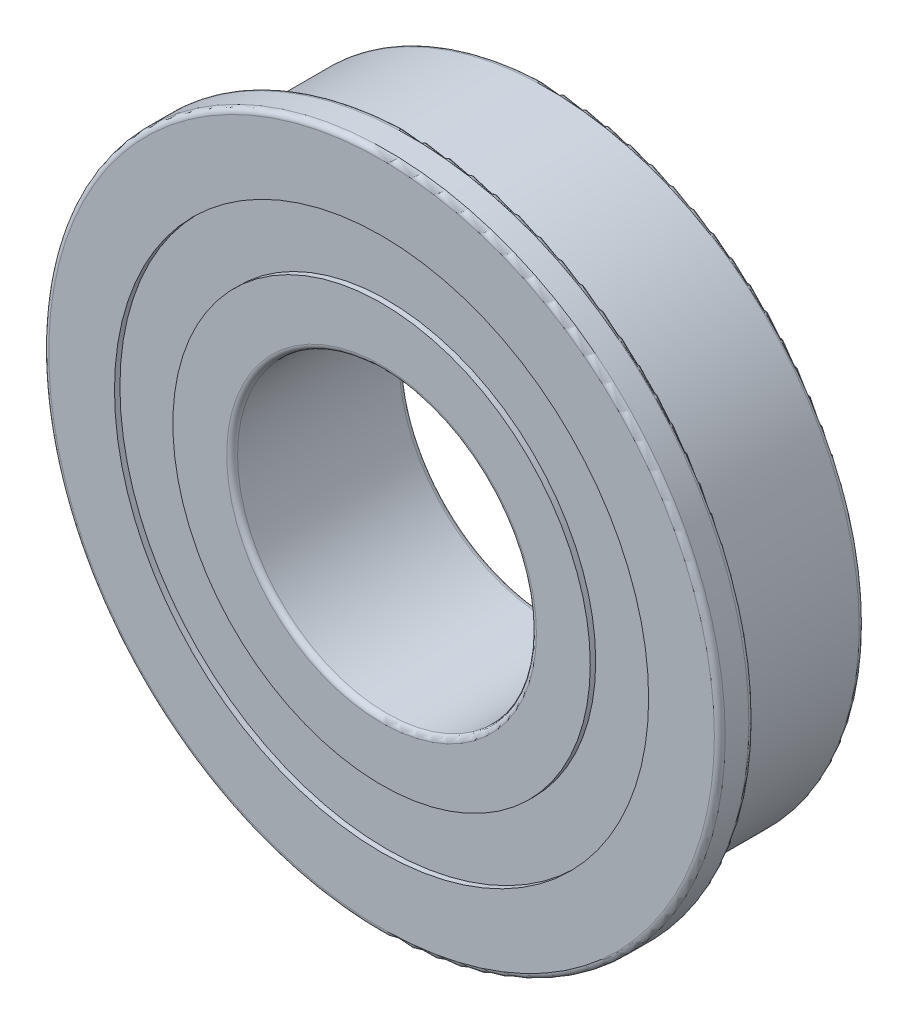
ISO-10303-21;
HEADER;
FILE_DESCRIPTION(('STEP AP214'),'2;1');
FILE_NAME('part.step','',(''),(''),'','','');
FILE_SCHEMA(('AUTOMOTIVE_DESIGN { 1 0 10303 214 1 1 1 1 }'));
ENDSEC;
DATA;
#1=APPLICATION_CONTEXT('core data for automotive mechanical design processes');
#2=APPLICATION_PROTOCOL_DEFINITION('international standard','automotive_design',2000,#1);
#3=PRODUCT_CONTEXT('',#1,'mechanical');
#4=PRODUCT('Part','Part','',(#3));
#5=PRODUCT_RELATED_PRODUCT_CATEGORY('part','',(#4));
#6=PRODUCT_DEFINITION_FORMATION('','',#4);
#7=PRODUCT_DEFINITION_CONTEXT('part definition',#1,'design');
#8=PRODUCT_DEFINITION('design','',#6,#7);
#9=PRODUCT_DEFINITION_SHAPE('','',#8);
#10=(LENGTH_UNIT() NAMED_UNIT(*) SI_UNIT(.MILLI.,.METRE.));
#11=(NAMED_UNIT(*) PLANE_ANGLE_UNIT() SI_UNIT($,.RADIAN.));
#12=(NAMED_UNIT(*) SI_UNIT($,.STERADIAN.) SOLID_ANGLE_UNIT());
#13=UNCERTAINTY_MEASURE_WITH_UNIT(LENGTH_MEASURE(1.E-05),#10,'distance_accuracy_value','');
#14=(GEOMETRIC_REPRESENTATION_CONTEXT(3) GLOBAL_UNCERTAINTY_ASSIGNED_CONTEXT((#13)) GLOBAL_UNIT_ASSIGNED_CONTEXT((#10,
#11,#12)) REPRESENTATION_CONTEXT('',''));
#15=CARTESIAN_POINT('',(0.,0.,0.));
#16=DIRECTION('',(0.,0.,1.));
#17=DIRECTION('',(1.,0.,0.));
#18=AXIS2_PLACEMENT_3D('',#15,#16,#17);
#19=CARTESIAN_POINT('',(0.,0.,-3.71875));
#20=DIRECTION('',(0.,0.,1.));
#21=DIRECTION('',(1.,0.,0.));
#22=AXIS2_PLACEMENT_3D('',#19,#20,#21);
#23=TOROIDAL_SURFACE('',#22,14.0375,0.25);
#24=CARTESIAN_POINT('',(0.,0.,-3.96875));
#25=DIRECTION('',(0.,0.,1.));
#26=DIRECTION('',(1.,0.,0.));
#27=AXIS2_PLACEMENT_3D('',#24,#25,#26);
#28=CIRCLE('',#27,14.0375);
#29=CARTESIAN_POINT('',(14.0375,0.,-3.96875));
#30=VERTEX_POINT('',#29);
#31=EDGE_CURVE('E10',#30,#30,#28,.T.);
#32=ORIENTED_EDGE('',*,*,#31,.T.);
#33=EDGE_LOOP('',(#32));
#34=FACE_BOUND('',#33,.T.);
#35=CARTESIAN_POINT('',(0.,0.,-3.71875));
#36=DIRECTION('',(0.,0.,1.));
#37=DIRECTION('',(1.,0.,0.));
#38=AXIS2_PLACEMENT_3D('',#35,#36,#37);
#39=CIRCLE('',#38,14.2875);
#40=CARTESIAN_POINT('',(14.2875,0.,-3.71875));
#41=VERTEX_POINT('',#40);
#42=EDGE_CURVE('E99',#41,#41,#39,.T.);
#43=ORIENTED_EDGE('',*,*,#42,.F.);
#44=EDGE_LOOP('',(#43));
#45=FACE_BOUND('',#44,.T.);
#46=ADVANCED_FACE('F32',(#34,#45),#23,.T.);
#47=CARTESIAN_POINT('',(14.0375,0.,-3.96875));
#48=DIRECTION('',(0.,0.,-1.));
#49=DIRECTION('',(-1.,0.,0.));
#50=AXIS2_PLACEMENT_3D('',#47,#48,#49);
#51=PLANE('',#50);
#52=CARTESIAN_POINT('',(0.,0.,-3.96875));
#53=DIRECTION('',(0.,0.,1.));
#54=DIRECTION('',(1.,0.,0.));
#55=AXIS2_PLACEMENT_3D('',#52,#53,#54);
#56=CIRCLE('',#55,12.2875);
#57=CARTESIAN_POINT('',(12.2875,0.,-3.96875));
#58=VERTEX_POINT('',#57);
#59=EDGE_CURVE('E38',#58,#58,#56,.T.);
#60=ORIENTED_EDGE('',*,*,#59,.T.);
#61=EDGE_LOOP('',(#60));
#62=FACE_BOUND('',#61,.T.);
#63=ORIENTED_EDGE('',*,*,#31,.F.);
#64=EDGE_LOOP('',(#63));
#65=FACE_BOUND('',#64,.T.);
#66=ADVANCED_FACE('F107',(#62,#65),#51,.T.);
#67=CARTESIAN_POINT('',(0.,0.,-3.9700039936204));
#68=DIRECTION('',(0.,0.,1.));
#69=DIRECTION('',(1.,0.,0.));
#70=AXIS2_PLACEMENT_3D('',#67,#68,#69);
#71=CYLINDRICAL_SURFACE('',#70,12.2875);
#72=CARTESIAN_POINT('',(0.,0.,-3.71875));
#73=DIRECTION('',(0.,0.,1.));
#74=DIRECTION('',(1.,0.,0.));
#75=AXIS2_PLACEMENT_3D('',#72,#73,#74);
#76=CIRCLE('',#75,12.2875);
#77=CARTESIAN_POINT('',(12.2875,0.,-3.71875));
#78=VERTEX_POINT('',#77);
#79=EDGE_CURVE('E42',#78,#78,#76,.T.);
#80=ORIENTED_EDGE('',*,*,#79,.T.);
#81=EDGE_LOOP('',(#80));
#82=FACE_BOUND('',#81,.T.);
#83=ORIENTED_EDGE('',*,*,#59,.F.);
#84=EDGE_LOOP('',(#83));
#85=FACE_BOUND('',#84,.T.);
#86=ADVANCED_FACE('F111',(#82,#85),#71,.F.);
#87=CARTESIAN_POINT('',(12.2875,0.,-3.71875));
#88=DIRECTION('',(0.,0.,-1.));
#89=DIRECTION('',(-1.,0.,0.));
#90=AXIS2_PLACEMENT_3D('',#87,#88,#89);
#91=PLANE('',#90);
#92=CARTESIAN_POINT('',(0.,0.,-3.71875));
#93=DIRECTION('',(0.,0.,1.));
#94=DIRECTION('',(1.,0.,0.));
#95=AXIS2_PLACEMENT_3D('',#92,#93,#94);
#96=CIRCLE('',#95,9.602);
#97=CARTESIAN_POINT('',(9.602,0.,-3.71875));
#98=VERTEX_POINT('',#97);
#99=EDGE_CURVE('E46',#98,#98,#96,.T.);
#100=ORIENTED_EDGE('',*,*,#99,.T.);
#101=EDGE_LOOP('',(#100));
#102=FACE_BOUND('',#101,.T.);
#103=ORIENTED_EDGE('',*,*,#79,.F.);
#104=EDGE_LOOP('',(#103));
#105=FACE_BOUND('',#104,.T.);
#106=ADVANCED_FACE('F115',(#102,#105),#91,.T.);
#107=CARTESIAN_POINT('',(0.,0.,-3.9700039936204));
#108=DIRECTION('',(0.,0.,1.));
#109=DIRECTION('',(1.,0.,0.));
#110=AXIS2_PLACEMENT_3D('',#107,#108,#109);
#111=CYLINDRICAL_SURFACE('',#110,9.602);
#112=CARTESIAN_POINT('',(0.,0.,-3.96875));
#113=DIRECTION('',(0.,0.,1.));
#114=DIRECTION('',(1.,0.,0.));
#115=AXIS2_PLACEMENT_3D('',#112,#113,#114);
#116=CIRCLE('',#115,9.602);
#117=CARTESIAN_POINT('',(9.602,0.,-3.96875));
#118=VERTEX_POINT('',#117);
#119=EDGE_CURVE('E51',#118,#118,#116,.T.);
#120=ORIENTED_EDGE('',*,*,#119,.T.);
#121=EDGE_LOOP('',(#120));
#122=FACE_BOUND('',#121,.T.);
#123=ORIENTED_EDGE('',*,*,#99,.F.);
#124=EDGE_LOOP('',(#123));
#125=FACE_BOUND('',#124,.T.);
#126=ADVANCED_FACE('F122',(#122,#125),#111,.T.);
#127=CARTESIAN_POINT('',(9.602,0.,-3.96875));
#128=DIRECTION('',(0.,0.,-1.));
#129=DIRECTION('',(-1.,0.,0.));
#130=AXIS2_PLACEMENT_3D('',#127,#128,#129);
#131=PLANE('',#130);
#132=CARTESIAN_POINT('',(0.,0.,-3.96875));
#133=DIRECTION('',(0.,0.,1.));
#134=DIRECTION('',(1.,0.,0.));
#135=AXIS2_PLACEMENT_3D('',#132,#133,#134);
#136=CIRCLE('',#135,7.125);
#137=CARTESIAN_POINT('',(7.125,0.,-3.96875));
#138=VERTEX_POINT('',#137);
#139=EDGE_CURVE('E54',#138,#138,#136,.T.);
#140=ORIENTED_EDGE('',*,*,#139,.T.);
#141=EDGE_LOOP('',(#140));
#142=FACE_BOUND('',#141,.T.);
#143=ORIENTED_EDGE('',*,*,#119,.F.);
#144=EDGE_LOOP('',(#143));
#145=FACE_BOUND('',#144,.T.);
#146=ADVANCED_FACE('F126',(#142,#145),#131,.T.);
#147=CARTESIAN_POINT('',(0.,0.,-3.71875));
#148=DIRECTION('',(0.,0.,1.));
#149=DIRECTION('',(1.,0.,0.));
#150=AXIS2_PLACEMENT_3D('',#147,#148,#149);
#151=TOROIDAL_SURFACE('',#150,7.125,0.25);
#152=CARTESIAN_POINT('',(0.,0.,-3.71875));
#153=DIRECTION('',(0.,0.,1.));
#154=DIRECTION('',(1.,0.,0.));
#155=AXIS2_PLACEMENT_3D('',#152,#153,#154);
#156=CIRCLE('',#155,6.875);
#157=CARTESIAN_POINT('',(6.875,0.,-3.71875));
#158=VERTEX_POINT('',#157);
#159=EDGE_CURVE('E57',#158,#158,#156,.T.);
#160=ORIENTED_EDGE('',*,*,#159,.T.);
#161=EDGE_LOOP('',(#160));
#162=FACE_BOUND('',#161,.T.);
#163=ORIENTED_EDGE('',*,*,#139,.F.);
#164=EDGE_LOOP('',(#163));
#165=FACE_BOUND('',#164,.T.);
#166=ADVANCED_FACE('F130',(#162,#165),#151,.T.);
#167=CARTESIAN_POINT('',(0.,0.,-3.9700039936204));
#168=DIRECTION('',(0.,0.,1.));
#169=DIRECTION('',(1.,0.,0.));
#170=AXIS2_PLACEMENT_3D('',#167,#168,#169);
#171=CYLINDRICAL_SURFACE('',#170,6.875);
#172=CARTESIAN_POINT('',(0.,0.,3.71875));
#173=DIRECTION('',(0.,0.,1.));
#174=DIRECTION('',(1.,0.,0.));
#175=AXIS2_PLACEMENT_3D('',#172,#173,#174);
#176=CIRCLE('',#175,6.875);
#177=CARTESIAN_POINT('',(6.875,0.,3.71875));
#178=VERTEX_POINT('',#177);
#179=EDGE_CURVE('E60',#178,#178,#176,.T.);
#180=ORIENTED_EDGE('',*,*,#179,.T.);
#181=EDGE_LOOP('',(#180));
#182=FACE_BOUND('',#181,.T.);
#183=ORIENTED_EDGE('',*,*,#159,.F.);
#184=EDGE_LOOP('',(#183));
#185=FACE_BOUND('',#184,.T.);
#186=ADVANCED_FACE('F134',(#182,#185),#171,.F.);
#187=CARTESIAN_POINT('',(0.,0.,3.71875));
#188=DIRECTION('',(0.,0.,1.));
#189=DIRECTION('',(1.,0.,0.));
#190=AXIS2_PLACEMENT_3D('',#187,#188,#189);
#191=TOROIDAL_SURFACE('',#190,7.125,0.25);
#192=CARTESIAN_POINT('',(0.,0.,3.96875));
#193=DIRECTION('',(0.,0.,1.));
#194=DIRECTION('',(1.,0.,0.));
#195=AXIS2_PLACEMENT_3D('',#192,#193,#194);
#196=CIRCLE('',#195,7.125);
#197=CARTESIAN_POINT('',(7.125,0.,3.96875));
#198=VERTEX_POINT('',#197);
#199=EDGE_CURVE('E63',#198,#198,#196,.T.);
#200=ORIENTED_EDGE('',*,*,#199,.T.);
#201=EDGE_LOOP('',(#200));
#202=FACE_BOUND('',#201,.T.);
#203=ORIENTED_EDGE('',*,*,#179,.F.);
#204=EDGE_LOOP('',(#203));
#205=FACE_BOUND('',#204,.T.);
#206=ADVANCED_FACE('F138',(#202,#205),#191,.T.);
#207=CARTESIAN_POINT('',(7.125,0.,3.96875));
#208=DIRECTION('',(0.,0.,1.));
#209=DIRECTION('',(1.,0.,0.));
#210=AXIS2_PLACEMENT_3D('',#207,#208,#209);
#211=PLANE('',#210);
#212=CARTESIAN_POINT('',(0.,0.,3.96875));
#213=DIRECTION('',(0.,0.,1.));
#214=DIRECTION('',(1.,0.,0.));
#215=AXIS2_PLACEMENT_3D('',#212,#213,#214);
#216=CIRCLE('',#215,9.602);
#217=CARTESIAN_POINT('',(9.602,0.,3.96875));
#218=VERTEX_POINT('',#217);
#219=EDGE_CURVE('E66',#218,#218,#216,.T.);
#220=ORIENTED_EDGE('',*,*,#219,.T.);
#221=EDGE_LOOP('',(#220));
#222=FACE_BOUND('',#221,.T.);
#223=ORIENTED_EDGE('',*,*,#199,.F.);
#224=EDGE_LOOP('',(#223));
#225=FACE_BOUND('',#224,.T.);
#226=ADVANCED_FACE('F142',(#222,#225),#211,.T.);
#227=CARTESIAN_POINT('',(0.,0.,-3.9700039936204));
#228=DIRECTION('',(0.,0.,1.));
#229=DIRECTION('',(1.,0.,0.));
#230=AXIS2_PLACEMENT_3D('',#227,#228,#229);
#231=CYLINDRICAL_SURFACE('',#230,9.602);
#232=CARTESIAN_POINT('',(0.,0.,3.71875));
#233=DIRECTION('',(0.,0.,1.));
#234=DIRECTION('',(1.,0.,0.));
#235=AXIS2_PLACEMENT_3D('',#232,#233,#234);
#236=CIRCLE('',#235,9.602);
#237=CARTESIAN_POINT('',(9.602,0.,3.71875));
#238=VERTEX_POINT('',#237);
#239=EDGE_CURVE('E69',#238,#238,#236,.T.);
#240=ORIENTED_EDGE('',*,*,#239,.T.);
#241=EDGE_LOOP('',(#240));
#242=FACE_BOUND('',#241,.T.);
#243=ORIENTED_EDGE('',*,*,#219,.F.);
#244=EDGE_LOOP('',(#243));
#245=FACE_BOUND('',#244,.T.);
#246=ADVANCED_FACE('F146',(#242,#245),#231,.T.);
#247=CARTESIAN_POINT('',(9.602,0.,3.71875));
#248=DIRECTION('',(0.,0.,1.));
#249=DIRECTION('',(1.,0.,0.));
#250=AXIS2_PLACEMENT_3D('',#247,#248,#249);
#251=PLANE('',#250);
#252=CARTESIAN_POINT('',(0.,0.,3.71875));
#253=DIRECTION('',(0.,0.,1.));
#254=DIRECTION('',(1.,0.,0.));
#255=AXIS2_PLACEMENT_3D('',#252,#253,#254);
#256=CIRCLE('',#255,12.2875);
#257=CARTESIAN_POINT('',(12.2875,0.,3.71875));
#258=VERTEX_POINT('',#257);
#259=EDGE_CURVE('E72',#258,#258,#256,.T.);
#260=ORIENTED_EDGE('',*,*,#259,.T.);
#261=EDGE_LOOP('',(#260));
#262=FACE_BOUND('',#261,.T.);
#263=ORIENTED_EDGE('',*,*,#239,.F.);
#264=EDGE_LOOP('',(#263));
#265=FACE_BOUND('',#264,.T.);
#266=ADVANCED_FACE('F150',(#262,#265),#251,.T.);
#267=CARTESIAN_POINT('',(0.,0.,-3.9700039936204));
#268=DIRECTION('',(0.,0.,1.));
#269=DIRECTION('',(1.,0.,0.));
#270=AXIS2_PLACEMENT_3D('',#267,#268,#269);
#271=CYLINDRICAL_SURFACE('',#270,12.2875);
#272=CARTESIAN_POINT('',(0.,0.,3.96875));
#273=DIRECTION('',(0.,0.,1.));
#274=DIRECTION('',(1.,0.,0.));
#275=AXIS2_PLACEMENT_3D('',#272,#273,#274);
#276=CIRCLE('',#275,12.2875);
#277=CARTESIAN_POINT('',(12.2875,0.,3.96875));
#278=VERTEX_POINT('',#277);
#279=EDGE_CURVE('E75',#278,#278,#276,.T.);
#280=ORIENTED_EDGE('',*,*,#279,.T.);
#281=EDGE_LOOP('',(#280));
#282=FACE_BOUND('',#281,.T.);
#283=ORIENTED_EDGE('',*,*,#259,.F.);
#284=EDGE_LOOP('',(#283));
#285=FACE_BOUND('',#284,.T.);
#286=ADVANCED_FACE('F154',(#282,#285),#271,.F.);
#287=CARTESIAN_POINT('',(12.2875,0.,3.96875));
#288=DIRECTION('',(0.,0.,1.));
#289=DIRECTION('',(1.,0.,0.));
#290=AXIS2_PLACEMENT_3D('',#287,#288,#289);
#291=PLANE('',#290);
#292=CARTESIAN_POINT('',(0.,0.,3.96875));
#293=DIRECTION('',(0.,0.,1.));
#294=DIRECTION('',(1.,0.,0.));
#295=AXIS2_PLACEMENT_3D('',#292,#293,#294);
#296=CIRCLE('',#295,15.31);
#297=CARTESIAN_POINT('',(15.31,0.,3.96875));
#298=VERTEX_POINT('',#297);
#299=EDGE_CURVE('E78',#298,#298,#296,.T.);
#300=ORIENTED_EDGE('',*,*,#299,.T.);
#301=EDGE_LOOP('',(#300));
#302=FACE_BOUND('',#301,.T.);
#303=ORIENTED_EDGE('',*,*,#279,.F.);
#304=EDGE_LOOP('',(#303));
#305=FACE_BOUND('',#304,.T.);
#306=ADVANCED_FACE('F158',(#302,#305),#291,.T.);
#307=CARTESIAN_POINT('',(0.,0.,3.71875));
#308=DIRECTION('',(0.,0.,1.));
#309=DIRECTION('',(1.,0.,0.));
#310=AXIS2_PLACEMENT_3D('',#307,#308,#309);
#311=TOROIDAL_SURFACE('',#310,15.31,0.25);
#312=CARTESIAN_POINT('',(0.,0.,3.71875));
#313=DIRECTION('',(0.,0.,1.));
#314=DIRECTION('',(1.,0.,0.));
#315=AXIS2_PLACEMENT_3D('',#312,#313,#314);
#316=CIRCLE('',#315,15.56);
#317=CARTESIAN_POINT('',(15.56,0.,3.71875));
#318=VERTEX_POINT('',#317);
#319=EDGE_CURVE('E81',#318,#318,#316,.T.);
#320=ORIENTED_EDGE('',*,*,#319,.T.);
#321=EDGE_LOOP('',(#320));
#322=FACE_BOUND('',#321,.T.);
#323=ORIENTED_EDGE('',*,*,#299,.F.);
#324=EDGE_LOOP('',(#323));
#325=FACE_BOUND('',#324,.T.);
#326=ADVANCED_FACE('F162',(#322,#325),#311,.T.);
#327=CARTESIAN_POINT('',(0.,0.,-3.9700039936204));
#328=DIRECTION('',(0.,0.,1.));
#329=DIRECTION('',(1.,0.,0.));
#330=AXIS2_PLACEMENT_3D('',#327,#328,#329);
#331=CYLINDRICAL_SURFACE('',#330,15.56);
#332=CARTESIAN_POINT('',(0.,0.,2.63125));
#333=DIRECTION('',(0.,0.,1.));
#334=DIRECTION('',(1.,0.,0.));
#335=AXIS2_PLACEMENT_3D('',#332,#333,#334);
#336=CIRCLE('',#335,15.56);
#337=CARTESIAN_POINT('',(15.56,0.,2.63125));
#338=VERTEX_POINT('',#337);
#339=EDGE_CURVE('E84',#338,#338,#336,.T.);
#340=ORIENTED_EDGE('',*,*,#339,.T.);
#341=EDGE_LOOP('',(#340));
#342=FACE_BOUND('',#341,.T.);
#343=ORIENTED_EDGE('',*,*,#319,.F.);
#344=EDGE_LOOP('',(#343));
#345=FACE_BOUND('',#344,.T.);
#346=ADVANCED_FACE('F166',(#342,#345),#331,.T.);
#347=CARTESIAN_POINT('',(0.,0.,2.63125));
#348=DIRECTION('',(0.,0.,1.));
#349=DIRECTION('',(1.,0.,0.));
#350=AXIS2_PLACEMENT_3D('',#347,#348,#349);
#351=TOROIDAL_SURFACE('',#350,15.31,0.25);
#352=CARTESIAN_POINT('',(0.,0.,2.38125));
#353=DIRECTION('',(0.,0.,1.));
#354=DIRECTION('',(1.,0.,0.));
#355=AXIS2_PLACEMENT_3D('',#352,#353,#354);
#356=CIRCLE('',#355,15.31);
#357=CARTESIAN_POINT('',(15.31,0.,2.38125));
#358=VERTEX_POINT('',#357);
#359=EDGE_CURVE('E87',#358,#358,#356,.T.);
#360=ORIENTED_EDGE('',*,*,#359,.T.);
#361=EDGE_LOOP('',(#360));
#362=FACE_BOUND('',#361,.T.);
#363=ORIENTED_EDGE('',*,*,#339,.F.);
#364=EDGE_LOOP('',(#363));
#365=FACE_BOUND('',#364,.T.);
#366=ADVANCED_FACE('F170',(#362,#365),#351,.T.);
#367=CARTESIAN_POINT('',(15.31,0.,2.38125));
#368=DIRECTION('',(0.,0.,-1.));
#369=DIRECTION('',(-1.,0.,0.));
#370=AXIS2_PLACEMENT_3D('',#367,#368,#369);
#371=PLANE('',#370);
#372=CARTESIAN_POINT('',(0.,0.,2.38125));
#373=DIRECTION('',(0.,0.,1.));
#374=DIRECTION('',(1.,0.,0.));
#375=AXIS2_PLACEMENT_3D('',#372,#373,#374);
#376=CIRCLE('',#375,14.2875);
#377=CARTESIAN_POINT('',(14.2875,0.,2.38125));
#378=VERTEX_POINT('',#377);
#379=EDGE_CURVE('E90',#378,#378,#376,.T.);
#380=ORIENTED_EDGE('',*,*,#379,.T.);
#381=EDGE_LOOP('',(#380));
#382=FACE_BOUND('',#381,.T.);
#383=ORIENTED_EDGE('',*,*,#359,.F.);
#384=EDGE_LOOP('',(#383));
#385=FACE_BOUND('',#384,.T.);
#386=ADVANCED_FACE('F174',(#382,#385),#371,.T.);
#387=CARTESIAN_POINT('',(0.,0.,2.13125));
#388=DIRECTION('',(0.,0.,1.));
#389=DIRECTION('',(1.,0.,0.));
#390=AXIS2_PLACEMENT_3D('',#387,#388,#389);
#391=TOROIDAL_SURFACE('',#390,14.2875,0.249999999999999);
#392=CARTESIAN_POINT('',(0.,0.,2.00625));
#393=DIRECTION('',(0.,0.,1.));
#394=DIRECTION('',(1.,0.,0.));
#395=AXIS2_PLACEMENT_3D('',#392,#393,#394);
#396=CIRCLE('',#395,14.0709936490539);
#397=CARTESIAN_POINT('',(14.0709936490539,0.,2.00625));
#398=VERTEX_POINT('',#397);
#399=EDGE_CURVE('E93',#398,#398,#396,.T.);
#400=ORIENTED_EDGE('',*,*,#399,.T.);
#401=EDGE_LOOP('',(#400));
#402=FACE_BOUND('',#401,.T.);
#403=ORIENTED_EDGE('',*,*,#379,.F.);
#404=EDGE_LOOP('',(#403));
#405=FACE_BOUND('',#404,.T.);
#406=ADVANCED_FACE('F178',(#402,#405),#391,.F.);
#407=CARTESIAN_POINT('',(0.,0.,2.00625));
#408=DIRECTION('',(0.,0.,-1.));
#409=DIRECTION('',(-1.,0.,0.));
#410=AXIS2_PLACEMENT_3D('',#407,#408,#409);
#411=CONICAL_SURFACE('',#410,14.0709936490539,0.523598775598294);
#412=CARTESIAN_POINT('',(0.,0.,1.63125));
#413=DIRECTION('',(0.,0.,1.));
#414=DIRECTION('',(1.,0.,0.));
#415=AXIS2_PLACEMENT_3D('',#412,#413,#414);
#416=CIRCLE('',#415,14.2875);
#417=CARTESIAN_POINT('',(14.2875,0.,1.63125));
#418=VERTEX_POINT('',#417);
#419=EDGE_CURVE('E96',#418,#418,#416,.T.);
#420=ORIENTED_EDGE('',*,*,#419,.T.);
#421=EDGE_LOOP('',(#420));
#422=FACE_BOUND('',#421,.T.);
#423=ORIENTED_EDGE('',*,*,#399,.F.);
#424=EDGE_LOOP('',(#423));
#425=FACE_BOUND('',#424,.T.);
#426=ADVANCED_FACE('F182',(#422,#425),#411,.T.);
#427=CARTESIAN_POINT('',(0.,0.,-3.9700039936204));
#428=DIRECTION('',(0.,0.,1.));
#429=DIRECTION('',(1.,0.,0.));
#430=AXIS2_PLACEMENT_3D('',#427,#428,#429);
#431=CYLINDRICAL_SURFACE('',#430,14.2875);
#432=ORIENTED_EDGE('',*,*,#42,.T.);
#433=EDGE_LOOP('',(#432));
#434=FACE_BOUND('',#433,.T.);
#435=ORIENTED_EDGE('',*,*,#419,.F.);
#436=EDGE_LOOP('',(#435));
#437=FACE_BOUND('',#436,.T.);
#438=ADVANCED_FACE('F103',(#434,#437),#431,.T.);
#439=CLOSED_SHELL('',(#46,#66,#86,#106,#126,#146,#166,#186,#206,#226,#246,#266,#286,#306,#326,
#346,#366,#386,#406,#426,#438));
#440=MANIFOLD_SOLID_BREP('B2',#439);
#441=ADVANCED_BREP_SHAPE_REPRESENTATION('',(#18,#440),#14);
#442=SHAPE_DEFINITION_REPRESENTATION(#9,#441);
ENDSEC;
END-ISO-10303-21;
